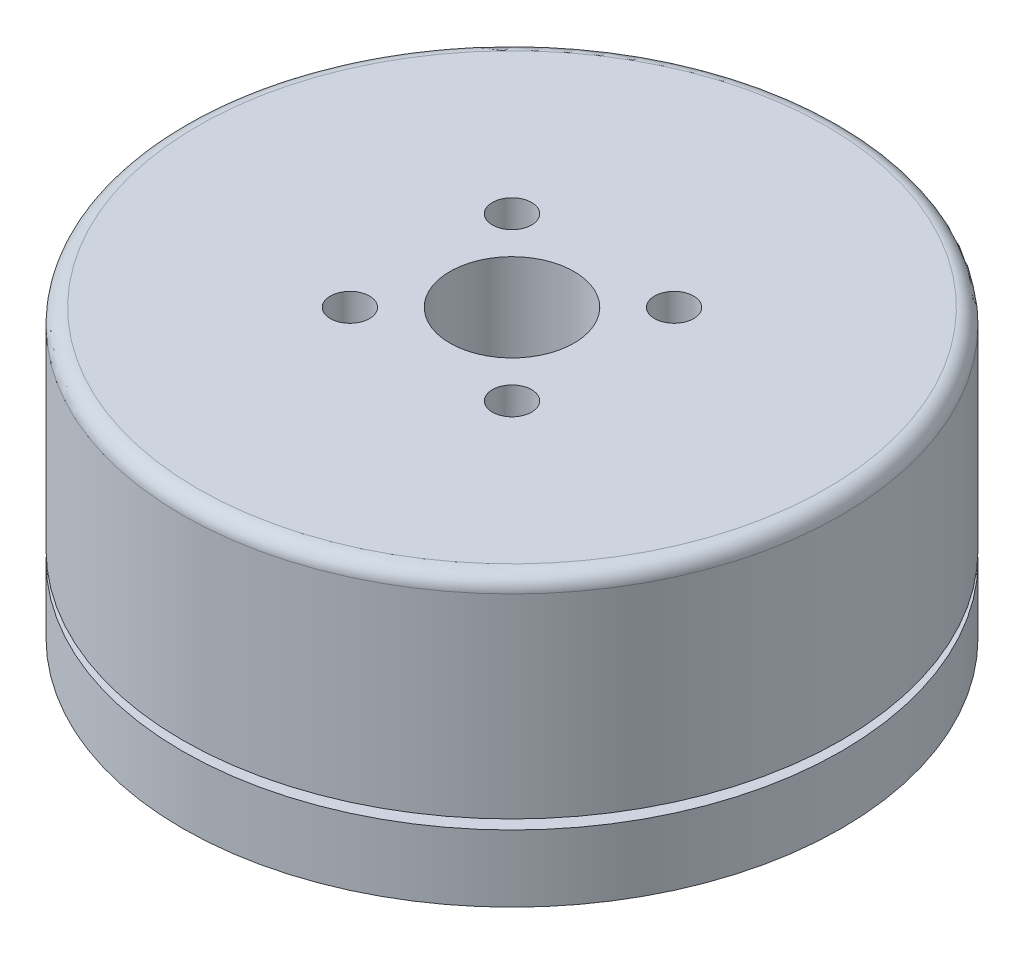
ISO-10303-21;
HEADER;
FILE_DESCRIPTION(('STEP AP214'),'2;1');
FILE_NAME('part.step','',(''),(''),'','','');
FILE_SCHEMA(('AUTOMOTIVE_DESIGN { 1 0 10303 214 1 1 1 1 }'));
ENDSEC;
DATA;
#1=APPLICATION_CONTEXT('core data for automotive mechanical design processes');
#2=APPLICATION_PROTOCOL_DEFINITION('international standard','automotive_design',2000,#1);
#3=PRODUCT_CONTEXT('',#1,'mechanical');
#4=PRODUCT('Part','Part','',(#3));
#5=PRODUCT_RELATED_PRODUCT_CATEGORY('part','',(#4));
#6=PRODUCT_DEFINITION_FORMATION('','',#4);
#7=PRODUCT_DEFINITION_CONTEXT('part definition',#1,'design');
#8=PRODUCT_DEFINITION('design','',#6,#7);
#9=PRODUCT_DEFINITION_SHAPE('','',#8);
#10=(LENGTH_UNIT() NAMED_UNIT(*) SI_UNIT(.MILLI.,.METRE.));
#11=(NAMED_UNIT(*) PLANE_ANGLE_UNIT() SI_UNIT($,.RADIAN.));
#12=(NAMED_UNIT(*) SI_UNIT($,.STERADIAN.) SOLID_ANGLE_UNIT());
#13=UNCERTAINTY_MEASURE_WITH_UNIT(LENGTH_MEASURE(1.E-05),#10,'distance_accuracy_value','');
#14=(GEOMETRIC_REPRESENTATION_CONTEXT(3) GLOBAL_UNCERTAINTY_ASSIGNED_CONTEXT((#13)) GLOBAL_UNIT_ASSIGNED_CONTEXT((#10,
#11,#12)) REPRESENTATION_CONTEXT('',''));
#15=CARTESIAN_POINT('',(0.,0.,0.));
#16=DIRECTION('',(0.,0.,1.));
#17=DIRECTION('',(1.,0.,0.));
#18=AXIS2_PLACEMENT_3D('',#15,#16,#17);
#19=CARTESIAN_POINT('',(0.,44.7192905148133,0.));
#20=DIRECTION('',(0.,1.,0.));
#21=DIRECTION('',(0.,0.,1.));
#22=AXIS2_PLACEMENT_3D('',#19,#20,#21);
#23=CYLINDRICAL_SURFACE('',#22,3.25);
#24=CARTESIAN_POINT('',(0.,16.62,0.));
#25=DIRECTION('',(0.,1.,0.));
#26=DIRECTION('',(0.,0.,1.));
#27=AXIS2_PLACEMENT_3D('',#24,#25,#26);
#28=CIRCLE('',#27,3.25);
#29=CARTESIAN_POINT('',(0.,16.62,3.25));
#30=VERTEX_POINT('',#29);
#31=EDGE_CURVE('E201',#30,#30,#28,.T.);
#32=ORIENTED_EDGE('',*,*,#31,.T.);
#33=EDGE_LOOP('',(#32));
#34=FACE_BOUND('',#33,.T.);
#35=CARTESIAN_POINT('',(0.,1.3,0.));
#36=DIRECTION('',(0.,-1.,0.));
#37=DIRECTION('',(0.,0.,-1.));
#38=AXIS2_PLACEMENT_3D('',#35,#36,#37);
#39=CIRCLE('',#38,3.25);
#40=CARTESIAN_POINT('',(0.,1.3,-3.25));
#41=VERTEX_POINT('',#40);
#42=EDGE_CURVE('E48',#41,#41,#39,.T.);
#43=ORIENTED_EDGE('',*,*,#42,.T.);
#44=EDGE_LOOP('',(#43));
#45=FACE_BOUND('',#44,.T.);
#46=ADVANCED_FACE('F44',(#34,#45),#23,.F.);
#47=CARTESIAN_POINT('',(-6.,1.62,0.));
#48=DIRECTION('',(0.,-1.,0.));
#49=DIRECTION('',(0.,0.,-1.));
#50=AXIS2_PLACEMENT_3D('',#47,#48,#49);
#51=PLANE('',#50);
#52=CARTESIAN_POINT('',(6.71751442127219,1.62,-6.71751442127221));
#53=DIRECTION('',(0.,-1.,0.));
#54=DIRECTION('',(0.,0.,-1.));
#55=AXIS2_PLACEMENT_3D('',#52,#53,#54);
#56=CIRCLE('',#55,1.025);
#57=CARTESIAN_POINT('',(6.71751442127219,1.62,-7.74251442127221));
#58=VERTEX_POINT('',#57);
#59=EDGE_CURVE('E167',#58,#58,#56,.T.);
#60=ORIENTED_EDGE('',*,*,#59,.F.);
#61=EDGE_LOOP('',(#60));
#62=FACE_BOUND('',#61,.T.);
#63=CARTESIAN_POINT('',(6.71751442127218,1.62,6.71751442127217));
#64=DIRECTION('',(0.,-1.,0.));
#65=DIRECTION('',(0.,0.,-1.));
#66=AXIS2_PLACEMENT_3D('',#63,#64,#65);
#67=CIRCLE('',#66,1.025);
#68=CARTESIAN_POINT('',(6.71751442127218,1.62,5.69251442127217));
#69=VERTEX_POINT('',#68);
#70=EDGE_CURVE('E173',#69,#69,#67,.T.);
#71=ORIENTED_EDGE('',*,*,#70,.F.);
#72=EDGE_LOOP('',(#71));
#73=FACE_BOUND('',#72,.T.);
#74=CARTESIAN_POINT('',(-6.71751442127218,1.62,6.71751442127221));
#75=DIRECTION('',(0.,-1.,0.));
#76=DIRECTION('',(0.,0.,-1.));
#77=AXIS2_PLACEMENT_3D('',#74,#75,#76);
#78=CIRCLE('',#77,1.025);
#79=CARTESIAN_POINT('',(-6.71751442127218,1.62,5.69251442127221));
#80=VERTEX_POINT('',#79);
#81=EDGE_CURVE('E179',#80,#80,#78,.T.);
#82=ORIENTED_EDGE('',*,*,#81,.F.);
#83=EDGE_LOOP('',(#82));
#84=FACE_BOUND('',#83,.T.);
#85=CARTESIAN_POINT('',(-6.71751442127219,1.62,-6.71751442127216));
#86=DIRECTION('',(0.,-1.,0.));
#87=DIRECTION('',(0.,0.,-1.));
#88=AXIS2_PLACEMENT_3D('',#85,#86,#87);
#89=CIRCLE('',#88,1.025);
#90=CARTESIAN_POINT('',(-6.71751442127219,1.62,-7.74251442127216));
#91=VERTEX_POINT('',#90);
#92=EDGE_CURVE('E185',#91,#91,#89,.T.);
#93=ORIENTED_EDGE('',*,*,#92,.F.);
#94=EDGE_LOOP('',(#93));
#95=FACE_BOUND('',#94,.T.);
#96=CARTESIAN_POINT('',(0.,1.62,0.));
#97=DIRECTION('',(0.,1.,0.));
#98=DIRECTION('',(0.,0.,1.));
#99=AXIS2_PLACEMENT_3D('',#96,#97,#98);
#100=CIRCLE('',#99,6.);
#101=CARTESIAN_POINT('',(0.,1.62,6.));
#102=VERTEX_POINT('',#101);
#103=EDGE_CURVE('E209',#102,#102,#100,.T.);
#104=ORIENTED_EDGE('',*,*,#103,.T.);
#105=EDGE_LOOP('',(#104));
#106=FACE_BOUND('',#105,.T.);
#107=CARTESIAN_POINT('',(0.,1.62,0.));
#108=DIRECTION('',(0.,1.,0.));
#109=DIRECTION('',(0.,0.,1.));
#110=AXIS2_PLACEMENT_3D('',#107,#108,#109);
#111=CIRCLE('',#110,17.25);
#112=CARTESIAN_POINT('',(0.,1.62,17.25));
#113=VERTEX_POINT('',#112);
#114=EDGE_CURVE('E206',#113,#113,#111,.T.);
#115=ORIENTED_EDGE('',*,*,#114,.F.);
#116=EDGE_LOOP('',(#115));
#117=FACE_BOUND('',#116,.T.);
#118=DIRECTION('',(1.,0.,0.));
#119=VECTOR('',#118,1.);
#120=CARTESIAN_POINT('',(-2.9,1.62,-15.25));
#121=LINE('',#120,#119);
#122=CARTESIAN_POINT('',(-2.9,1.62,-15.25));
#123=VERTEX_POINT('',#122);
#124=CARTESIAN_POINT('',(2.9,1.62,-15.25));
#125=VERTEX_POINT('',#124);
#126=EDGE_CURVE('E154',#123,#125,#121,.T.);
#127=ORIENTED_EDGE('',*,*,#126,.F.);
#128=DIRECTION('',(0.,0.,-1.));
#129=VECTOR('',#128,1.);
#130=CARTESIAN_POINT('',(-2.9,1.62,-15.25));
#131=LINE('',#130,#129);
#132=CARTESIAN_POINT('',(-2.9,1.62,-13.75));
#133=VERTEX_POINT('',#132);
#134=EDGE_CURVE('E140',#133,#123,#131,.T.);
#135=ORIENTED_EDGE('',*,*,#134,.F.);
#136=DIRECTION('',(-1.,0.,0.));
#137=VECTOR('',#136,1.);
#138=CARTESIAN_POINT('',(-2.9,1.62,-13.75));
#139=LINE('',#138,#137);
#140=CARTESIAN_POINT('',(2.9,1.62,-13.75));
#141=VERTEX_POINT('',#140);
#142=EDGE_CURVE('E145',#141,#133,#139,.T.);
#143=ORIENTED_EDGE('',*,*,#142,.F.);
#144=DIRECTION('',(0.,0.,1.));
#145=VECTOR('',#144,1.);
#146=CARTESIAN_POINT('',(2.9,1.62,-15.25));
#147=LINE('',#146,#145);
#148=EDGE_CURVE('E156',#125,#141,#147,.T.);
#149=ORIENTED_EDGE('',*,*,#148,.F.);
#150=EDGE_LOOP('',(#127,#135,#143,#149));
#151=FACE_BOUND('',#150,.T.);
#152=ADVANCED_FACE('F234',(#62,#73,#84,#95,#106,#117,#151),#51,.T.);
#153=CARTESIAN_POINT('',(0.,44.7192905148133,0.));
#154=DIRECTION('',(0.,1.,0.));
#155=DIRECTION('',(0.,0.,1.));
#156=AXIS2_PLACEMENT_3D('',#153,#154,#155);
#157=CYLINDRICAL_SURFACE('',#156,17.25);
#158=CARTESIAN_POINT('',(0.,15.82,0.));
#159=DIRECTION('',(0.,1.,0.));
#160=DIRECTION('',(0.,0.,1.));
#161=AXIS2_PLACEMENT_3D('',#158,#159,#160);
#162=CIRCLE('',#161,17.25);
#163=CARTESIAN_POINT('',(0.,15.82,17.25));
#164=VERTEX_POINT('',#163);
#165=EDGE_CURVE('E12',#164,#164,#162,.F.);
#166=ORIENTED_EDGE('',*,*,#165,.T.);
#167=EDGE_LOOP('',(#166));
#168=FACE_BOUND('',#167,.T.);
#169=CARTESIAN_POINT('',(0.,5.62,0.));
#170=DIRECTION('',(0.,-1.,0.));
#171=DIRECTION('',(0.,0.,-1.));
#172=AXIS2_PLACEMENT_3D('',#169,#170,#171);
#173=CIRCLE('',#172,17.25);
#174=CARTESIAN_POINT('',(0.,5.62,-17.25));
#175=VERTEX_POINT('',#174);
#176=EDGE_CURVE('E198',#175,#175,#173,.T.);
#177=ORIENTED_EDGE('',*,*,#176,.F.);
#178=EDGE_LOOP('',(#177));
#179=FACE_BOUND('',#178,.T.);
#180=ADVANCED_FACE('F240',(#168,#179),#157,.T.);
#181=CARTESIAN_POINT('',(-3.25,0.,0.));
#182=DIRECTION('',(0.,-1.,0.));
#183=DIRECTION('',(0.,0.,-1.));
#184=AXIS2_PLACEMENT_3D('',#181,#182,#183);
#185=PLANE('',#184);
#186=CARTESIAN_POINT('',(0.,0.,0.));
#187=DIRECTION('',(0.,-1.,0.));
#188=DIRECTION('',(0.,0.,-1.));
#189=AXIS2_PLACEMENT_3D('',#186,#187,#188);
#190=CIRCLE('',#189,4.);
#191=CARTESIAN_POINT('',(0.,0.,-4.));
#192=VERTEX_POINT('',#191);
#193=EDGE_CURVE('E268',#192,#192,#190,.T.);
#194=ORIENTED_EDGE('',*,*,#193,.F.);
#195=EDGE_LOOP('',(#194));
#196=FACE_BOUND('',#195,.T.);
#197=CARTESIAN_POINT('',(0.,0.,0.));
#198=DIRECTION('',(0.,1.,0.));
#199=DIRECTION('',(0.,0.,1.));
#200=AXIS2_PLACEMENT_3D('',#197,#198,#199);
#201=CIRCLE('',#200,5.99999999999999);
#202=CARTESIAN_POINT('',(0.,0.,5.99999999999999));
#203=VERTEX_POINT('',#202);
#204=EDGE_CURVE('E212',#203,#203,#201,.T.);
#205=ORIENTED_EDGE('',*,*,#204,.F.);
#206=EDGE_LOOP('',(#205));
#207=FACE_BOUND('',#206,.T.);
#208=ADVANCED_FACE('F257',(#196,#207),#185,.T.);
#209=CARTESIAN_POINT('',(0.,44.7192905148133,0.));
#210=DIRECTION('',(0.,1.,0.));
#211=DIRECTION('',(0.,0.,1.));
#212=AXIS2_PLACEMENT_3D('',#209,#210,#211);
#213=CYLINDRICAL_SURFACE('',#212,5.99999999999999);
#214=ORIENTED_EDGE('',*,*,#204,.T.);
#215=EDGE_LOOP('',(#214));
#216=FACE_BOUND('',#215,.T.);
#217=ORIENTED_EDGE('',*,*,#103,.F.);
#218=EDGE_LOOP('',(#217));
#219=FACE_BOUND('',#218,.T.);
#220=ADVANCED_FACE('F253',(#216,#219),#213,.T.);
#221=CARTESIAN_POINT('',(0.,5.12,0.));
#222=DIRECTION('',(0.,-1.,0.));
#223=DIRECTION('',(0.,0.,-1.));
#224=AXIS2_PLACEMENT_3D('',#221,#222,#223);
#225=CIRCLE('',#224,17.25);
#226=CARTESIAN_POINT('',(0.,5.12,-17.25));
#227=VERTEX_POINT('',#226);
#228=EDGE_CURVE('E195',#227,#227,#225,.T.);
#229=ORIENTED_EDGE('',*,*,#228,.T.);
#230=EDGE_LOOP('',(#229));
#231=FACE_BOUND('',#230,.T.);
#232=ORIENTED_EDGE('',*,*,#114,.T.);
#233=EDGE_LOOP('',(#232));
#234=FACE_BOUND('',#233,.T.);
#235=ADVANCED_FACE('F251',(#231,#234),#157,.T.);
#236=CARTESIAN_POINT('',(-17.25,16.62,0.));
#237=DIRECTION('',(0.,1.,0.));
#238=DIRECTION('',(0.,0.,1.));
#239=AXIS2_PLACEMENT_3D('',#236,#237,#238);
#240=PLANE('',#239);
#241=CARTESIAN_POINT('',(0.,16.62,0.));
#242=DIRECTION('',(0.,1.,0.));
#243=DIRECTION('',(0.,0.,1.));
#244=AXIS2_PLACEMENT_3D('',#241,#242,#243);
#245=CIRCLE('',#244,16.45);
#246=CARTESIAN_POINT('',(0.,16.62,16.45));
#247=VERTEX_POINT('',#246);
#248=EDGE_CURVE('E53',#247,#247,#245,.T.);
#249=ORIENTED_EDGE('',*,*,#248,.T.);
#250=EDGE_LOOP('',(#249));
#251=FACE_BOUND('',#250,.T.);
#252=CARTESIAN_POINT('',(-4.24264068711925,16.62,-4.24264068711932));
#253=DIRECTION('',(0.,1.,0.));
#254=DIRECTION('',(0.,0.,1.));
#255=AXIS2_PLACEMENT_3D('',#252,#253,#254);
#256=CIRCLE('',#255,1.025);
#257=CARTESIAN_POINT('',(-4.24264068711925,16.62,-3.21764068711932));
#258=VERTEX_POINT('',#257);
#259=EDGE_CURVE('E117',#258,#258,#256,.T.);
#260=ORIENTED_EDGE('',*,*,#259,.F.);
#261=EDGE_LOOP('',(#260));
#262=FACE_BOUND('',#261,.T.);
#263=CARTESIAN_POINT('',(4.24264068711925,16.62,-4.24264068711932));
#264=DIRECTION('',(0.,1.,0.));
#265=DIRECTION('',(0.,0.,1.));
#266=AXIS2_PLACEMENT_3D('',#263,#264,#265);
#267=CIRCLE('',#266,1.025);
#268=CARTESIAN_POINT('',(4.24264068711925,16.62,-3.21764068711932));
#269=VERTEX_POINT('',#268);
#270=EDGE_CURVE('E116',#269,#269,#267,.T.);
#271=ORIENTED_EDGE('',*,*,#270,.F.);
#272=EDGE_LOOP('',(#271));
#273=FACE_BOUND('',#272,.T.);
#274=CARTESIAN_POINT('',(4.24264068711925,16.62,4.24264068711932));
#275=DIRECTION('',(0.,1.,0.));
#276=DIRECTION('',(0.,0.,1.));
#277=AXIS2_PLACEMENT_3D('',#274,#275,#276);
#278=CIRCLE('',#277,1.025);
#279=CARTESIAN_POINT('',(4.24264068711925,16.62,5.26764068711932));
#280=VERTEX_POINT('',#279);
#281=EDGE_CURVE('E128',#280,#280,#278,.T.);
#282=ORIENTED_EDGE('',*,*,#281,.F.);
#283=EDGE_LOOP('',(#282));
#284=FACE_BOUND('',#283,.T.);
#285=CARTESIAN_POINT('',(-4.24264068711925,16.62,4.24264068711932));
#286=DIRECTION('',(0.,1.,0.));
#287=DIRECTION('',(0.,0.,1.));
#288=AXIS2_PLACEMENT_3D('',#285,#286,#287);
#289=CIRCLE('',#288,1.025);
#290=CARTESIAN_POINT('',(-4.24264068711925,16.62,5.26764068711932));
#291=VERTEX_POINT('',#290);
#292=EDGE_CURVE('E134',#291,#291,#289,.T.);
#293=ORIENTED_EDGE('',*,*,#292,.F.);
#294=EDGE_LOOP('',(#293));
#295=FACE_BOUND('',#294,.T.);
#296=ORIENTED_EDGE('',*,*,#31,.F.);
#297=EDGE_LOOP('',(#296));
#298=FACE_BOUND('',#297,.T.);
#299=ADVANCED_FACE('F218',(#251,#262,#273,#284,#295,#298),#240,.T.);
#300=CARTESIAN_POINT('',(0.,5.62,0.));
#301=DIRECTION('',(0.,-1.,0.));
#302=DIRECTION('',(0.,0.,-1.));
#303=AXIS2_PLACEMENT_3D('',#300,#301,#302);
#304=PLANE('',#303);
#305=CARTESIAN_POINT('',(0.,5.62,0.));
#306=DIRECTION('',(0.,-1.,0.));
#307=DIRECTION('',(1.,0.,0.));
#308=AXIS2_PLACEMENT_3D('',#305,#306,#307);
#309=CIRCLE('',#308,16.25);
#310=CARTESIAN_POINT('',(16.25,5.62,0.));
#311=VERTEX_POINT('',#310);
#312=EDGE_CURVE('E192',#311,#311,#309,.T.);
#313=ORIENTED_EDGE('',*,*,#312,.F.);
#314=EDGE_LOOP('',(#313));
#315=FACE_BOUND('',#314,.T.);
#316=ORIENTED_EDGE('',*,*,#176,.T.);
#317=EDGE_LOOP('',(#316));
#318=FACE_BOUND('',#317,.T.);
#319=ADVANCED_FACE('F250',(#315,#318),#304,.T.);
#320=CARTESIAN_POINT('',(0.,5.12,0.));
#321=DIRECTION('',(0.,-1.,0.));
#322=DIRECTION('',(0.,0.,-1.));
#323=AXIS2_PLACEMENT_3D('',#320,#321,#322);
#324=PLANE('',#323);
#325=CARTESIAN_POINT('',(0.,5.12,0.));
#326=DIRECTION('',(0.,-1.,0.));
#327=DIRECTION('',(1.,0.,0.));
#328=AXIS2_PLACEMENT_3D('',#325,#326,#327);
#329=CIRCLE('',#328,16.25);
#330=CARTESIAN_POINT('',(16.25,5.12,0.));
#331=VERTEX_POINT('',#330);
#332=EDGE_CURVE('E191',#331,#331,#329,.T.);
#333=ORIENTED_EDGE('',*,*,#332,.T.);
#334=EDGE_LOOP('',(#333));
#335=FACE_BOUND('',#334,.T.);
#336=ORIENTED_EDGE('',*,*,#228,.F.);
#337=EDGE_LOOP('',(#336));
#338=FACE_BOUND('',#337,.T.);
#339=ADVANCED_FACE('F246',(#335,#338),#324,.F.);
#340=CARTESIAN_POINT('',(0.,5.62,0.));
#341=DIRECTION('',(0.,-1.,0.));
#342=DIRECTION('',(0.,0.,-1.));
#343=AXIS2_PLACEMENT_3D('',#340,#341,#342);
#344=CYLINDRICAL_SURFACE('',#343,16.25);
#345=ORIENTED_EDGE('',*,*,#312,.T.);
#346=EDGE_LOOP('',(#345));
#347=FACE_BOUND('',#346,.T.);
#348=ORIENTED_EDGE('',*,*,#332,.F.);
#349=EDGE_LOOP('',(#348));
#350=FACE_BOUND('',#349,.T.);
#351=ADVANCED_FACE('F340',(#347,#350),#344,.T.);
#352=CARTESIAN_POINT('',(-6.71751442127219,5.12,-6.71751442127216));
#353=DIRECTION('',(0.,-1.,0.));
#354=DIRECTION('',(0.,0.,-1.));
#355=AXIS2_PLACEMENT_3D('',#352,#353,#354);
#356=CONICAL_SURFACE('',#355,1.025,1.02974425867665);
#357=CARTESIAN_POINT('',(-6.71751442127219,5.73588213450325,-6.71751442127216));
#358=VERTEX_POINT('',#357);
#359=VERTEX_LOOP('',#358);
#360=FACE_BOUND('',#359,.T.);
#361=CARTESIAN_POINT('',(-6.71751442127219,5.12,-6.71751442127216));
#362=DIRECTION('',(0.,-1.,0.));
#363=DIRECTION('',(0.,0.,-1.));
#364=AXIS2_PLACEMENT_3D('',#361,#362,#363);
#365=CIRCLE('',#364,1.025);
#366=CARTESIAN_POINT('',(-6.71751442127219,5.12,-7.74251442127216));
#367=VERTEX_POINT('',#366);
#368=EDGE_CURVE('E188',#367,#367,#365,.T.);
#369=ORIENTED_EDGE('',*,*,#368,.T.);
#370=EDGE_LOOP('',(#369));
#371=FACE_BOUND('',#370,.T.);
#372=ADVANCED_FACE('F336',(#360,#371),#356,.F.);
#373=CARTESIAN_POINT('',(-6.71751442127219,1.62,-6.71751442127216));
#374=DIRECTION('',(0.,-1.,0.));
#375=DIRECTION('',(0.,0.,-1.));
#376=AXIS2_PLACEMENT_3D('',#373,#374,#375);
#377=CYLINDRICAL_SURFACE('',#376,1.025);
#378=ORIENTED_EDGE('',*,*,#368,.F.);
#379=EDGE_LOOP('',(#378));
#380=FACE_BOUND('',#379,.T.);
#381=ORIENTED_EDGE('',*,*,#92,.T.);
#382=EDGE_LOOP('',(#381));
#383=FACE_BOUND('',#382,.T.);
#384=ADVANCED_FACE('F332',(#380,#383),#377,.F.);
#385=CARTESIAN_POINT('',(-6.71751442127218,5.12,6.71751442127221));
#386=DIRECTION('',(0.,-1.,0.));
#387=DIRECTION('',(0.,0.,-1.));
#388=AXIS2_PLACEMENT_3D('',#385,#386,#387);
#389=CONICAL_SURFACE('',#388,1.025,1.02974425867665);
#390=CARTESIAN_POINT('',(-6.71751442127218,5.73588213450325,6.71751442127221));
#391=VERTEX_POINT('',#390);
#392=VERTEX_LOOP('',#391);
#393=FACE_BOUND('',#392,.T.);
#394=CARTESIAN_POINT('',(-6.71751442127218,5.12,6.71751442127221));
#395=DIRECTION('',(0.,-1.,0.));
#396=DIRECTION('',(0.,0.,-1.));
#397=AXIS2_PLACEMENT_3D('',#394,#395,#396);
#398=CIRCLE('',#397,1.025);
#399=CARTESIAN_POINT('',(-6.71751442127218,5.12,5.69251442127221));
#400=VERTEX_POINT('',#399);
#401=EDGE_CURVE('E182',#400,#400,#398,.T.);
#402=ORIENTED_EDGE('',*,*,#401,.T.);
#403=EDGE_LOOP('',(#402));
#404=FACE_BOUND('',#403,.T.);
#405=ADVANCED_FACE('F328',(#393,#404),#389,.F.);
#406=CARTESIAN_POINT('',(-6.71751442127218,1.62,6.71751442127221));
#407=DIRECTION('',(0.,-1.,0.));
#408=DIRECTION('',(0.,0.,-1.));
#409=AXIS2_PLACEMENT_3D('',#406,#407,#408);
#410=CYLINDRICAL_SURFACE('',#409,1.025);
#411=ORIENTED_EDGE('',*,*,#401,.F.);
#412=EDGE_LOOP('',(#411));
#413=FACE_BOUND('',#412,.T.);
#414=ORIENTED_EDGE('',*,*,#81,.T.);
#415=EDGE_LOOP('',(#414));
#416=FACE_BOUND('',#415,.T.);
#417=ADVANCED_FACE('F324',(#413,#416),#410,.F.);
#418=CARTESIAN_POINT('',(6.71751442127218,5.12,6.71751442127217));
#419=DIRECTION('',(0.,-1.,0.));
#420=DIRECTION('',(0.,0.,-1.));
#421=AXIS2_PLACEMENT_3D('',#418,#419,#420);
#422=CONICAL_SURFACE('',#421,1.025,1.02974425867665);
#423=CARTESIAN_POINT('',(6.71751442127218,5.73588213450325,6.71751442127217));
#424=VERTEX_POINT('',#423);
#425=VERTEX_LOOP('',#424);
#426=FACE_BOUND('',#425,.T.);
#427=CARTESIAN_POINT('',(6.71751442127218,5.12,6.71751442127217));
#428=DIRECTION('',(0.,-1.,0.));
#429=DIRECTION('',(0.,0.,-1.));
#430=AXIS2_PLACEMENT_3D('',#427,#428,#429);
#431=CIRCLE('',#430,1.025);
#432=CARTESIAN_POINT('',(6.71751442127218,5.12,5.69251442127217));
#433=VERTEX_POINT('',#432);
#434=EDGE_CURVE('E176',#433,#433,#431,.T.);
#435=ORIENTED_EDGE('',*,*,#434,.T.);
#436=EDGE_LOOP('',(#435));
#437=FACE_BOUND('',#436,.T.);
#438=ADVANCED_FACE('F320',(#426,#437),#422,.F.);
#439=CARTESIAN_POINT('',(6.71751442127218,1.62,6.71751442127217));
#440=DIRECTION('',(0.,-1.,0.));
#441=DIRECTION('',(0.,0.,-1.));
#442=AXIS2_PLACEMENT_3D('',#439,#440,#441);
#443=CYLINDRICAL_SURFACE('',#442,1.025);
#444=ORIENTED_EDGE('',*,*,#434,.F.);
#445=EDGE_LOOP('',(#444));
#446=FACE_BOUND('',#445,.T.);
#447=ORIENTED_EDGE('',*,*,#70,.T.);
#448=EDGE_LOOP('',(#447));
#449=FACE_BOUND('',#448,.T.);
#450=ADVANCED_FACE('F316',(#446,#449),#443,.F.);
#451=CARTESIAN_POINT('',(6.71751442127219,5.12,-6.71751442127221));
#452=DIRECTION('',(0.,-1.,0.));
#453=DIRECTION('',(0.,0.,-1.));
#454=AXIS2_PLACEMENT_3D('',#451,#452,#453);
#455=CONICAL_SURFACE('',#454,1.025,1.02974425867665);
#456=CARTESIAN_POINT('',(6.71751442127219,5.73588213450325,-6.71751442127221));
#457=VERTEX_POINT('',#456);
#458=VERTEX_LOOP('',#457);
#459=FACE_BOUND('',#458,.T.);
#460=CARTESIAN_POINT('',(6.71751442127219,5.12,-6.71751442127221));
#461=DIRECTION('',(0.,-1.,0.));
#462=DIRECTION('',(0.,0.,-1.));
#463=AXIS2_PLACEMENT_3D('',#460,#461,#462);
#464=CIRCLE('',#463,1.025);
#465=CARTESIAN_POINT('',(6.71751442127219,5.12,-7.74251442127221));
#466=VERTEX_POINT('',#465);
#467=EDGE_CURVE('E170',#466,#466,#464,.T.);
#468=ORIENTED_EDGE('',*,*,#467,.T.);
#469=EDGE_LOOP('',(#468));
#470=FACE_BOUND('',#469,.T.);
#471=ADVANCED_FACE('F312',(#459,#470),#455,.F.);
#472=CARTESIAN_POINT('',(6.71751442127219,1.62,-6.71751442127221));
#473=DIRECTION('',(0.,-1.,0.));
#474=DIRECTION('',(0.,0.,-1.));
#475=AXIS2_PLACEMENT_3D('',#472,#473,#474);
#476=CYLINDRICAL_SURFACE('',#475,1.025);
#477=ORIENTED_EDGE('',*,*,#467,.F.);
#478=EDGE_LOOP('',(#477));
#479=FACE_BOUND('',#478,.T.);
#480=ORIENTED_EDGE('',*,*,#59,.T.);
#481=EDGE_LOOP('',(#480));
#482=FACE_BOUND('',#481,.T.);
#483=ADVANCED_FACE('F309',(#479,#482),#476,.F.);
#484=CARTESIAN_POINT('',(-2.9,-2.38,-15.25));
#485=DIRECTION('',(1.,0.,0.));
#486=DIRECTION('',(0.,0.,-1.));
#487=AXIS2_PLACEMENT_3D('',#484,#485,#486);
#488=PLANE('',#487);
#489=ORIENTED_EDGE('',*,*,#134,.T.);
#490=DIRECTION('',(0.,1.,0.));
#491=VECTOR('',#490,1.);
#492=CARTESIAN_POINT('',(-2.9,-2.38,-15.25));
#493=LINE('',#492,#491);
#494=CARTESIAN_POINT('',(-2.9,-2.38,-15.25));
#495=VERTEX_POINT('',#494);
#496=EDGE_CURVE('E165',#495,#123,#493,.T.);
#497=ORIENTED_EDGE('',*,*,#496,.F.);
#498=DIRECTION('',(0.,0.,-1.));
#499=VECTOR('',#498,1.);
#500=CARTESIAN_POINT('',(-2.9,-2.38,-15.25));
#501=LINE('',#500,#499);
#502=CARTESIAN_POINT('',(-2.9,-2.38,-13.75));
#503=VERTEX_POINT('',#502);
#504=EDGE_CURVE('E141',#503,#495,#501,.T.);
#505=ORIENTED_EDGE('',*,*,#504,.F.);
#506=DIRECTION('',(0.,1.,0.));
#507=VECTOR('',#506,1.);
#508=CARTESIAN_POINT('',(-2.9,-2.38,-13.75));
#509=LINE('',#508,#507);
#510=EDGE_CURVE('E151',#503,#133,#509,.T.);
#511=ORIENTED_EDGE('',*,*,#510,.T.);
#512=EDGE_LOOP('',(#489,#497,#505,#511));
#513=FACE_BOUND('',#512,.T.);
#514=ADVANCED_FACE('F292',(#513),#488,.F.);
#515=CARTESIAN_POINT('',(-2.9,-2.38,-15.25));
#516=DIRECTION('',(0.,0.,1.));
#517=DIRECTION('',(1.,0.,0.));
#518=AXIS2_PLACEMENT_3D('',#515,#516,#517);
#519=PLANE('',#518);
#520=ORIENTED_EDGE('',*,*,#126,.T.);
#521=DIRECTION('',(0.,1.,0.));
#522=VECTOR('',#521,1.);
#523=CARTESIAN_POINT('',(2.9,-2.38,-15.25));
#524=LINE('',#523,#522);
#525=CARTESIAN_POINT('',(2.9,-2.38,-15.25));
#526=VERTEX_POINT('',#525);
#527=EDGE_CURVE('E162',#526,#125,#524,.T.);
#528=ORIENTED_EDGE('',*,*,#527,.F.);
#529=DIRECTION('',(1.,0.,0.));
#530=VECTOR('',#529,1.);
#531=CARTESIAN_POINT('',(-2.9,-2.38,-15.25));
#532=LINE('',#531,#530);
#533=EDGE_CURVE('E144',#495,#526,#532,.T.);
#534=ORIENTED_EDGE('',*,*,#533,.F.);
#535=ORIENTED_EDGE('',*,*,#496,.T.);
#536=EDGE_LOOP('',(#520,#528,#534,#535));
#537=FACE_BOUND('',#536,.T.);
#538=ADVANCED_FACE('F282',(#537),#519,.F.);
#539=CARTESIAN_POINT('',(2.9,-2.38,-15.25));
#540=DIRECTION('',(-1.,0.,0.));
#541=DIRECTION('',(0.,0.,1.));
#542=AXIS2_PLACEMENT_3D('',#539,#540,#541);
#543=PLANE('',#542);
#544=ORIENTED_EDGE('',*,*,#148,.T.);
#545=DIRECTION('',(0.,1.,0.));
#546=VECTOR('',#545,1.);
#547=CARTESIAN_POINT('',(2.9,-2.38,-13.75));
#548=LINE('',#547,#546);
#549=CARTESIAN_POINT('',(2.9,-2.38,-13.75));
#550=VERTEX_POINT('',#549);
#551=EDGE_CURVE('E60',#550,#141,#548,.T.);
#552=ORIENTED_EDGE('',*,*,#551,.F.);
#553=DIRECTION('',(0.,0.,1.));
#554=VECTOR('',#553,1.);
#555=CARTESIAN_POINT('',(2.9,-2.38,-15.25));
#556=LINE('',#555,#554);
#557=EDGE_CURVE('E147',#526,#550,#556,.T.);
#558=ORIENTED_EDGE('',*,*,#557,.F.);
#559=ORIENTED_EDGE('',*,*,#527,.T.);
#560=EDGE_LOOP('',(#544,#552,#558,#559));
#561=FACE_BOUND('',#560,.T.);
#562=ADVANCED_FACE('F286',(#561),#543,.F.);
#563=CARTESIAN_POINT('',(-2.9,-2.38,-13.75));
#564=DIRECTION('',(0.,0.,-1.));
#565=DIRECTION('',(-1.,0.,0.));
#566=AXIS2_PLACEMENT_3D('',#563,#564,#565);
#567=PLANE('',#566);
#568=ORIENTED_EDGE('',*,*,#142,.T.);
#569=ORIENTED_EDGE('',*,*,#510,.F.);
#570=DIRECTION('',(-1.,0.,0.));
#571=VECTOR('',#570,1.);
#572=CARTESIAN_POINT('',(-2.9,-2.38,-13.75));
#573=LINE('',#572,#571);
#574=EDGE_CURVE('E149',#550,#503,#573,.T.);
#575=ORIENTED_EDGE('',*,*,#574,.F.);
#576=ORIENTED_EDGE('',*,*,#551,.T.);
#577=EDGE_LOOP('',(#568,#569,#575,#576));
#578=FACE_BOUND('',#577,.T.);
#579=ADVANCED_FACE('F293',(#578),#567,.F.);
#580=CARTESIAN_POINT('',(0.,-2.38,0.));
#581=DIRECTION('',(0.,1.,0.));
#582=DIRECTION('',(0.,0.,1.));
#583=AXIS2_PLACEMENT_3D('',#580,#581,#582);
#584=PLANE('',#583);
#585=ORIENTED_EDGE('',*,*,#504,.T.);
#586=ORIENTED_EDGE('',*,*,#533,.T.);
#587=ORIENTED_EDGE('',*,*,#557,.T.);
#588=ORIENTED_EDGE('',*,*,#574,.T.);
#589=EDGE_LOOP('',(#585,#586,#587,#588));
#590=FACE_BOUND('',#589,.T.);
#591=ADVANCED_FACE('F288',(#590),#584,.F.);
#592=CARTESIAN_POINT('',(-4.24264068711925,13.12,4.24264068711932));
#593=DIRECTION('',(0.,1.,0.));
#594=DIRECTION('',(0.,0.,1.));
#595=AXIS2_PLACEMENT_3D('',#592,#593,#594);
#596=CONICAL_SURFACE('',#595,1.025,1.02974425867665);
#597=CARTESIAN_POINT('',(-4.24264068711926,12.5041178654967,4.24264068711932));
#598=VERTEX_POINT('',#597);
#599=VERTEX_LOOP('',#598);
#600=FACE_BOUND('',#599,.T.);
#601=CARTESIAN_POINT('',(-4.24264068711925,13.12,4.24264068711932));
#602=DIRECTION('',(0.,1.,0.));
#603=DIRECTION('',(0.,0.,1.));
#604=AXIS2_PLACEMENT_3D('',#601,#602,#603);
#605=CIRCLE('',#604,1.025);
#606=CARTESIAN_POINT('',(-4.24264068711925,13.12,5.26764068711932));
#607=VERTEX_POINT('',#606);
#608=EDGE_CURVE('E137',#607,#607,#605,.T.);
#609=ORIENTED_EDGE('',*,*,#608,.T.);
#610=EDGE_LOOP('',(#609));
#611=FACE_BOUND('',#610,.T.);
#612=ADVANCED_FACE('F300',(#600,#611),#596,.F.);
#613=CARTESIAN_POINT('',(-4.24264068711925,16.62,4.24264068711932));
#614=DIRECTION('',(0.,1.,0.));
#615=DIRECTION('',(0.,0.,1.));
#616=AXIS2_PLACEMENT_3D('',#613,#614,#615);
#617=CYLINDRICAL_SURFACE('',#616,1.025);
#618=ORIENTED_EDGE('',*,*,#608,.F.);
#619=EDGE_LOOP('',(#618));
#620=FACE_BOUND('',#619,.T.);
#621=ORIENTED_EDGE('',*,*,#292,.T.);
#622=EDGE_LOOP('',(#621));
#623=FACE_BOUND('',#622,.T.);
#624=ADVANCED_FACE('F434',(#620,#623),#617,.F.);
#625=CARTESIAN_POINT('',(4.24264068711925,13.12,4.24264068711932));
#626=DIRECTION('',(0.,1.,0.));
#627=DIRECTION('',(0.,0.,1.));
#628=AXIS2_PLACEMENT_3D('',#625,#626,#627);
#629=CONICAL_SURFACE('',#628,1.025,1.02974425867665);
#630=CARTESIAN_POINT('',(4.24264068711925,12.5041178654967,4.24264068711932));
#631=VERTEX_POINT('',#630);
#632=VERTEX_LOOP('',#631);
#633=FACE_BOUND('',#632,.T.);
#634=CARTESIAN_POINT('',(4.24264068711925,13.12,4.24264068711932));
#635=DIRECTION('',(0.,1.,0.));
#636=DIRECTION('',(0.,0.,1.));
#637=AXIS2_PLACEMENT_3D('',#634,#635,#636);
#638=CIRCLE('',#637,1.025);
#639=CARTESIAN_POINT('',(4.24264068711925,13.12,5.26764068711932));
#640=VERTEX_POINT('',#639);
#641=EDGE_CURVE('E131',#640,#640,#638,.T.);
#642=ORIENTED_EDGE('',*,*,#641,.T.);
#643=EDGE_LOOP('',(#642));
#644=FACE_BOUND('',#643,.T.);
#645=ADVANCED_FACE('F444',(#633,#644),#629,.F.);
#646=CARTESIAN_POINT('',(4.24264068711925,16.62,4.24264068711932));
#647=DIRECTION('',(0.,1.,0.));
#648=DIRECTION('',(0.,0.,1.));
#649=AXIS2_PLACEMENT_3D('',#646,#647,#648);
#650=CYLINDRICAL_SURFACE('',#649,1.025);
#651=ORIENTED_EDGE('',*,*,#641,.F.);
#652=EDGE_LOOP('',(#651));
#653=FACE_BOUND('',#652,.T.);
#654=ORIENTED_EDGE('',*,*,#281,.T.);
#655=EDGE_LOOP('',(#654));
#656=FACE_BOUND('',#655,.T.);
#657=ADVANCED_FACE('F457',(#653,#656),#650,.F.);
#658=CARTESIAN_POINT('',(4.24264068711925,13.12,-4.24264068711932));
#659=DIRECTION('',(0.,1.,0.));
#660=DIRECTION('',(0.,0.,1.));
#661=AXIS2_PLACEMENT_3D('',#658,#659,#660);
#662=CONICAL_SURFACE('',#661,1.025,1.02974425867665);
#663=CARTESIAN_POINT('',(4.24264068711925,12.5041178654967,-4.24264068711932));
#664=VERTEX_POINT('',#663);
#665=VERTEX_LOOP('',#664);
#666=FACE_BOUND('',#665,.T.);
#667=CARTESIAN_POINT('',(4.24264068711925,13.12,-4.24264068711932));
#668=DIRECTION('',(0.,1.,0.));
#669=DIRECTION('',(0.,0.,1.));
#670=AXIS2_PLACEMENT_3D('',#667,#668,#669);
#671=CIRCLE('',#670,1.025);
#672=CARTESIAN_POINT('',(4.24264068711925,13.12,-3.21764068711932));
#673=VERTEX_POINT('',#672);
#674=EDGE_CURVE('E120',#673,#673,#671,.T.);
#675=ORIENTED_EDGE('',*,*,#674,.T.);
#676=EDGE_LOOP('',(#675));
#677=FACE_BOUND('',#676,.T.);
#678=ADVANCED_FACE('F467',(#666,#677),#662,.F.);
#679=CARTESIAN_POINT('',(4.24264068711925,16.62,-4.24264068711932));
#680=DIRECTION('',(0.,1.,0.));
#681=DIRECTION('',(0.,0.,1.));
#682=AXIS2_PLACEMENT_3D('',#679,#680,#681);
#683=CYLINDRICAL_SURFACE('',#682,1.025);
#684=ORIENTED_EDGE('',*,*,#674,.F.);
#685=EDGE_LOOP('',(#684));
#686=FACE_BOUND('',#685,.T.);
#687=ORIENTED_EDGE('',*,*,#270,.T.);
#688=EDGE_LOOP('',(#687));
#689=FACE_BOUND('',#688,.T.);
#690=ADVANCED_FACE('F110',(#686,#689),#683,.F.);
#691=CARTESIAN_POINT('',(-4.24264068711925,13.12,-4.24264068711932));
#692=DIRECTION('',(0.,1.,0.));
#693=DIRECTION('',(0.,0.,1.));
#694=AXIS2_PLACEMENT_3D('',#691,#692,#693);
#695=CONICAL_SURFACE('',#694,1.025,1.02974425867665);
#696=CARTESIAN_POINT('',(-4.24264068711926,12.5041178654967,-4.24264068711932));
#697=VERTEX_POINT('',#696);
#698=VERTEX_LOOP('',#697);
#699=FACE_BOUND('',#698,.T.);
#700=CARTESIAN_POINT('',(-4.24264068711925,13.12,-4.24264068711932));
#701=DIRECTION('',(0.,1.,0.));
#702=DIRECTION('',(0.,0.,1.));
#703=AXIS2_PLACEMENT_3D('',#700,#701,#702);
#704=CIRCLE('',#703,1.025);
#705=CARTESIAN_POINT('',(-4.24264068711925,13.12,-3.21764068711932));
#706=VERTEX_POINT('',#705);
#707=EDGE_CURVE('E114',#706,#706,#704,.T.);
#708=ORIENTED_EDGE('',*,*,#707,.T.);
#709=EDGE_LOOP('',(#708));
#710=FACE_BOUND('',#709,.T.);
#711=ADVANCED_FACE('F106',(#699,#710),#695,.F.);
#712=CARTESIAN_POINT('',(-4.24264068711925,16.62,-4.24264068711932));
#713=DIRECTION('',(0.,1.,0.));
#714=DIRECTION('',(0.,0.,1.));
#715=AXIS2_PLACEMENT_3D('',#712,#713,#714);
#716=CYLINDRICAL_SURFACE('',#715,1.025);
#717=ORIENTED_EDGE('',*,*,#707,.F.);
#718=EDGE_LOOP('',(#717));
#719=FACE_BOUND('',#718,.T.);
#720=ORIENTED_EDGE('',*,*,#259,.T.);
#721=EDGE_LOOP('',(#720));
#722=FACE_BOUND('',#721,.T.);
#723=ADVANCED_FACE('F109',(#719,#722),#716,.F.);
#724=CARTESIAN_POINT('',(0.,15.82,0.));
#725=DIRECTION('',(0.,1.,0.));
#726=DIRECTION('',(0.,0.,1.));
#727=AXIS2_PLACEMENT_3D('',#724,#725,#726);
#728=TOROIDAL_SURFACE('',#727,16.45,0.8);
#729=ORIENTED_EDGE('',*,*,#165,.F.);
#730=EDGE_LOOP('',(#729));
#731=FACE_BOUND('',#730,.T.);
#732=ORIENTED_EDGE('',*,*,#248,.F.);
#733=EDGE_LOOP('',(#732));
#734=FACE_BOUND('',#733,.T.);
#735=ADVANCED_FACE('F46',(#731,#734),#728,.T.);
#736=CARTESIAN_POINT('',(0.,1.3,0.));
#737=DIRECTION('',(0.,-1.,0.));
#738=DIRECTION('',(0.,0.,-1.));
#739=AXIS2_PLACEMENT_3D('',#736,#737,#738);
#740=CYLINDRICAL_SURFACE('',#739,4.);
#741=CARTESIAN_POINT('',(0.,1.3,0.));
#742=DIRECTION('',(0.,-1.,0.));
#743=DIRECTION('',(0.,0.,-1.));
#744=AXIS2_PLACEMENT_3D('',#741,#742,#743);
#745=CIRCLE('',#744,4.);
#746=CARTESIAN_POINT('',(0.,1.3,-4.));
#747=VERTEX_POINT('',#746);
#748=EDGE_CURVE('E555',#747,#747,#745,.T.);
#749=ORIENTED_EDGE('',*,*,#748,.F.);
#750=EDGE_LOOP('',(#749));
#751=FACE_BOUND('',#750,.T.);
#752=ORIENTED_EDGE('',*,*,#193,.T.);
#753=EDGE_LOOP('',(#752));
#754=FACE_BOUND('',#753,.T.);
#755=ADVANCED_FACE('F222',(#751,#754),#740,.F.);
#756=CARTESIAN_POINT('',(0.,1.3,0.));
#757=DIRECTION('',(0.,-1.,0.));
#758=DIRECTION('',(0.,0.,-1.));
#759=AXIS2_PLACEMENT_3D('',#756,#757,#758);
#760=PLANE('',#759);
#761=ORIENTED_EDGE('',*,*,#42,.F.);
#762=EDGE_LOOP('',(#761));
#763=FACE_BOUND('',#762,.T.);
#764=ORIENTED_EDGE('',*,*,#748,.T.);
#765=EDGE_LOOP('',(#764));
#766=FACE_BOUND('',#765,.T.);
#767=ADVANCED_FACE('F228',(#763,#766),#760,.T.);
#768=CLOSED_SHELL('',(#46,#152,#180,#208,#220,#235,#299,#319,#339,#351,#372,#384,#405,#417,#438,
#450,#471,#483,#514,#538,#562,#579,#591,#612,#624,#645,#657,#678,#690,#711,#723,#735,#755,#767));
#769=MANIFOLD_SOLID_BREP('B2',#768);
#770=ADVANCED_BREP_SHAPE_REPRESENTATION('',(#18,#769),#14);
#771=SHAPE_DEFINITION_REPRESENTATION(#9,#770);
ENDSEC;
END-ISO-10303-21;
